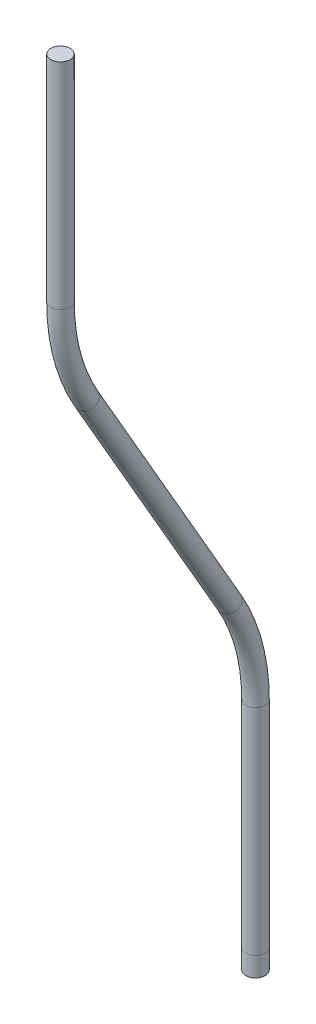
ISO-10303-21;
HEADER;
FILE_DESCRIPTION(('STEP AP214'),'2;1');
FILE_NAME('part.step','',(''),(''),'','','');
FILE_SCHEMA(('AUTOMOTIVE_DESIGN { 1 0 10303 214 1 1 1 1 }'));
ENDSEC;
DATA;
#1=APPLICATION_CONTEXT('core data for automotive mechanical design processes');
#2=APPLICATION_PROTOCOL_DEFINITION('international standard','automotive_design',2000,#1);
#3=PRODUCT_CONTEXT('',#1,'mechanical');
#4=PRODUCT('Part','Part','',(#3));
#5=PRODUCT_RELATED_PRODUCT_CATEGORY('part','',(#4));
#6=PRODUCT_DEFINITION_FORMATION('','',#4);
#7=PRODUCT_DEFINITION_CONTEXT('part definition',#1,'design');
#8=PRODUCT_DEFINITION('design','',#6,#7);
#9=PRODUCT_DEFINITION_SHAPE('','',#8);
#10=(LENGTH_UNIT() NAMED_UNIT(*) SI_UNIT(.MILLI.,.METRE.));
#11=(NAMED_UNIT(*) PLANE_ANGLE_UNIT() SI_UNIT($,.RADIAN.));
#12=(NAMED_UNIT(*) SI_UNIT($,.STERADIAN.) SOLID_ANGLE_UNIT());
#13=UNCERTAINTY_MEASURE_WITH_UNIT(LENGTH_MEASURE(1.E-05),#10,'distance_accuracy_value','');
#14=(GEOMETRIC_REPRESENTATION_CONTEXT(3) GLOBAL_UNCERTAINTY_ASSIGNED_CONTEXT((#13)) GLOBAL_UNIT_ASSIGNED_CONTEXT((#10,
#11,#12)) REPRESENTATION_CONTEXT('',''));
#15=CARTESIAN_POINT('',(0.,0.,0.));
#16=DIRECTION('',(0.,0.,1.));
#17=DIRECTION('',(1.,0.,0.));
#18=AXIS2_PLACEMENT_3D('',#15,#16,#17);
#19=CARTESIAN_POINT('',(0.,91.3589838486225,20.));
#20=DIRECTION('',(0.,1.,0.));
#21=DIRECTION('',(0.,0.,1.));
#22=AXIS2_PLACEMENT_3D('',#19,#20,#21);
#23=PLANE('',#22);
#24=CARTESIAN_POINT('',(0.,91.3589838486225,20.));
#25=DIRECTION('',(0.,1.,0.));
#26=DIRECTION('',(0.,0.,1.));
#27=AXIS2_PLACEMENT_3D('',#24,#25,#26);
#28=CIRCLE('',#27,1.);
#29=CARTESIAN_POINT('',(0.,91.3589838486225,21.));
#30=VERTEX_POINT('',#29);
#31=EDGE_CURVE('E66',#30,#30,#28,.T.);
#32=ORIENTED_EDGE('',*,*,#31,.T.);
#33=EDGE_LOOP('',(#32));
#34=FACE_BOUND('',#33,.T.);
#35=ADVANCED_FACE('F53',(#34),#23,.T.);
#36=CARTESIAN_POINT('',(0.,0.,0.));
#37=DIRECTION('',(0.,1.,0.));
#38=DIRECTION('',(0.,0.,1.));
#39=AXIS2_PLACEMENT_3D('',#36,#37,#38);
#40=PLANE('',#39);
#41=CARTESIAN_POINT('',(0.,0.,0.));
#42=DIRECTION('',(0.,1.,0.));
#43=DIRECTION('',(0.,0.,1.));
#44=AXIS2_PLACEMENT_3D('',#41,#42,#43);
#45=CIRCLE('',#44,1.);
#46=CARTESIAN_POINT('',(0.,0.,1.));
#47=VERTEX_POINT('',#46);
#48=EDGE_CURVE('E12',#47,#47,#45,.T.);
#49=ORIENTED_EDGE('',*,*,#48,.F.);
#50=EDGE_LOOP('',(#49));
#51=FACE_BOUND('',#50,.T.);
#52=ADVANCED_FACE('F73',(#51),#40,.F.);
#53=CARTESIAN_POINT('',(0.,91.3589838486225,20.));
#54=DIRECTION('',(0.,-1.,0.));
#55=DIRECTION('',(0.,0.,-1.));
#56=AXIS2_PLACEMENT_3D('',#53,#54,#55);
#57=CYLINDRICAL_SURFACE('',#56,1.);
#58=CARTESIAN_POINT('',(0.,69.3589838486225,20.));
#59=DIRECTION('',(0.,1.,0.));
#60=DIRECTION('',(0.,0.,1.));
#61=AXIS2_PLACEMENT_3D('',#58,#59,#60);
#62=CIRCLE('',#61,1.);
#63=CARTESIAN_POINT('',(0.,69.3589838486225,21.));
#64=VERTEX_POINT('',#63);
#65=EDGE_CURVE('E111',#64,#64,#62,.T.);
#66=ORIENTED_EDGE('',*,*,#65,.T.);
#67=EDGE_LOOP('',(#66));
#68=FACE_BOUND('',#67,.T.);
#69=ORIENTED_EDGE('',*,*,#31,.F.);
#70=EDGE_LOOP('',(#69));
#71=FACE_BOUND('',#70,.T.);
#72=ADVANCED_FACE('F75',(#68,#71),#57,.T.);
#73=CARTESIAN_POINT('',(0.,69.3589838486225,0.));
#74=DIRECTION('',(1.,0.,0.));
#75=DIRECTION('',(0.,0.,-1.));
#76=AXIS2_PLACEMENT_3D('',#73,#74,#75);
#77=TOROIDAL_SURFACE('',#76,20.,1.);
#78=CARTESIAN_POINT('',(0.,59.3589838486225,17.3205080756888));
#79=DIRECTION('',(0.,0.866025403784439,0.499999999999999));
#80=DIRECTION('',(0.,-0.499999999999999,0.866025403784439));
#81=AXIS2_PLACEMENT_3D('',#78,#79,#80);
#82=CIRCLE('',#81,1.);
#83=CARTESIAN_POINT('',(0.,58.8589838486225,18.1865334794732));
#84=VERTEX_POINT('',#83);
#85=EDGE_CURVE('E108',#84,#84,#82,.T.);
#86=CARTESIAN_POINT('',(0.,69.3589838486225,0.));
#87=DIRECTION('',(1.,0.,0.));
#88=DIRECTION('',(0.,0.,-1.));
#89=AXIS2_PLACEMENT_3D('',#86,#87,#88);
#90=CIRCLE('',#89,21.);
#91=EDGE_CURVE('',#64,#84,#90,.T.);
#92=ORIENTED_EDGE('',*,*,#65,.F.);
#93=ORIENTED_EDGE('',*,*,#85,.T.);
#94=ORIENTED_EDGE('',*,*,#91,.T.);
#95=ORIENTED_EDGE('',*,*,#91,.F.);
#96=EDGE_LOOP('',(#92,#94,#93,#95));
#97=FACE_BOUND('',#96,.T.);
#98=ADVANCED_FACE('F80',(#97),#77,.T.);
#99=CARTESIAN_POINT('',(0.,59.3589838486225,17.3205080756888));
#100=DIRECTION('',(0.,-0.866025403784439,-0.499999999999999));
#101=DIRECTION('',(0.,0.499999999999999,-0.866025403784439));
#102=AXIS2_PLACEMENT_3D('',#99,#100,#101);
#103=CYLINDRICAL_SURFACE('',#102,1.);
#104=CARTESIAN_POINT('',(0.,34.,2.67949192431123));
#105=DIRECTION('',(0.,0.866025403784439,0.499999999999999));
#106=DIRECTION('',(0.,-0.499999999999999,0.866025403784439));
#107=AXIS2_PLACEMENT_3D('',#104,#105,#106);
#108=CIRCLE('',#107,1.);
#109=CARTESIAN_POINT('',(0.,34.5,1.81346652052678));
#110=VERTEX_POINT('',#109);
#111=EDGE_CURVE('E116',#110,#110,#108,.T.);
#112=ORIENTED_EDGE('',*,*,#111,.T.);
#113=EDGE_LOOP('',(#112));
#114=FACE_BOUND('',#113,.T.);
#115=ORIENTED_EDGE('',*,*,#85,.F.);
#116=EDGE_LOOP('',(#115));
#117=FACE_BOUND('',#116,.T.);
#118=ADVANCED_FACE('F96',(#114,#117),#103,.T.);
#119=CARTESIAN_POINT('',(0.,24.,20.));
#120=DIRECTION('',(-1.,0.,0.));
#121=DIRECTION('',(0.,0.,1.));
#122=AXIS2_PLACEMENT_3D('',#119,#120,#121);
#123=TOROIDAL_SURFACE('',#122,20.,1.);
#124=CARTESIAN_POINT('',(0.,24.,0.));
#125=DIRECTION('',(0.,1.,0.));
#126=DIRECTION('',(0.,0.,1.));
#127=AXIS2_PLACEMENT_3D('',#124,#125,#126);
#128=CIRCLE('',#127,1.);
#129=CARTESIAN_POINT('',(0.,24.,-0.999999999999997));
#130=VERTEX_POINT('',#129);
#131=EDGE_CURVE('E122',#130,#130,#128,.T.);
#132=CARTESIAN_POINT('',(0.,24.,20.));
#133=DIRECTION('',(-1.,0.,0.));
#134=DIRECTION('',(0.,0.,1.));
#135=AXIS2_PLACEMENT_3D('',#132,#133,#134);
#136=CIRCLE('',#135,21.);
#137=EDGE_CURVE('',#110,#130,#136,.T.);
#138=ORIENTED_EDGE('',*,*,#111,.F.);
#139=ORIENTED_EDGE('',*,*,#131,.T.);
#140=ORIENTED_EDGE('',*,*,#137,.T.);
#141=ORIENTED_EDGE('',*,*,#137,.F.);
#142=EDGE_LOOP('',(#138,#140,#139,#141));
#143=FACE_BOUND('',#142,.T.);
#144=ADVANCED_FACE('F90',(#143),#123,.T.);
#145=CARTESIAN_POINT('',(0.,24.,0.));
#146=DIRECTION('',(0.,-1.,0.));
#147=DIRECTION('',(0.,0.,-1.));
#148=AXIS2_PLACEMENT_3D('',#145,#146,#147);
#149=CYLINDRICAL_SURFACE('',#148,1.);
#150=CARTESIAN_POINT('',(0.,2.,0.));
#151=DIRECTION('',(0.,1.,0.));
#152=DIRECTION('',(0.,0.,1.));
#153=AXIS2_PLACEMENT_3D('',#150,#151,#152);
#154=CIRCLE('',#153,1.);
#155=CARTESIAN_POINT('',(0.,2.,1.));
#156=VERTEX_POINT('',#155);
#157=EDGE_CURVE('E61',#156,#156,#154,.T.);
#158=ORIENTED_EDGE('',*,*,#157,.T.);
#159=EDGE_LOOP('',(#158));
#160=FACE_BOUND('',#159,.T.);
#161=ORIENTED_EDGE('',*,*,#131,.F.);
#162=EDGE_LOOP('',(#161));
#163=FACE_BOUND('',#162,.T.);
#164=ADVANCED_FACE('F86',(#160,#163),#149,.T.);
#165=CARTESIAN_POINT('',(0.,2.,0.));
#166=DIRECTION('',(0.,-1.,0.));
#167=DIRECTION('',(0.,0.,-1.));
#168=AXIS2_PLACEMENT_3D('',#165,#166,#167);
#169=CYLINDRICAL_SURFACE('',#168,1.);
#170=ORIENTED_EDGE('',*,*,#48,.T.);
#171=EDGE_LOOP('',(#170));
#172=FACE_BOUND('',#171,.T.);
#173=ORIENTED_EDGE('',*,*,#157,.F.);
#174=EDGE_LOOP('',(#173));
#175=FACE_BOUND('',#174,.T.);
#176=ADVANCED_FACE('F70',(#172,#175),#169,.T.);
#177=CLOSED_SHELL('',(#35,#52,#72,#98,#118,#144,#164,#176));
#178=MANIFOLD_SOLID_BREP('B2',#177);
#179=ADVANCED_BREP_SHAPE_REPRESENTATION('',(#18,#178),#14);
#180=SHAPE_DEFINITION_REPRESENTATION(#9,#179);
ENDSEC;
END-ISO-10303-21;
